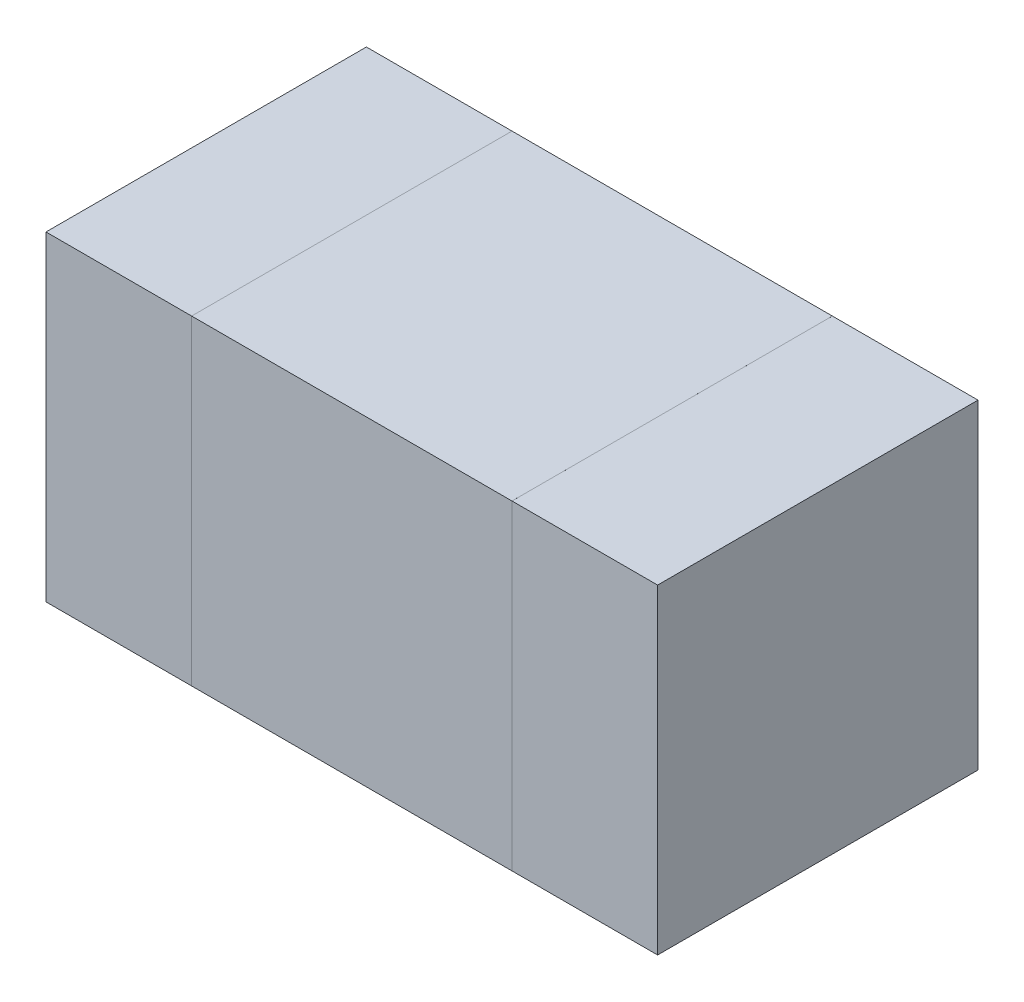
ISO-10303-21;
HEADER;
FILE_DESCRIPTION(('STEP AP214'),'2;1');
FILE_NAME('part.step','',(''),(''),'','','');
FILE_SCHEMA(('AUTOMOTIVE_DESIGN { 1 0 10303 214 1 1 1 1 }'));
ENDSEC;
DATA;
#1=APPLICATION_CONTEXT('core data for automotive mechanical design processes');
#2=APPLICATION_PROTOCOL_DEFINITION('international standard','automotive_design',2000,#1);
#3=PRODUCT_CONTEXT('',#1,'mechanical');
#4=PRODUCT('Part','Part','',(#3));
#5=PRODUCT_RELATED_PRODUCT_CATEGORY('part','',(#4));
#6=PRODUCT_DEFINITION_FORMATION('','',#4);
#7=PRODUCT_DEFINITION_CONTEXT('part definition',#1,'design');
#8=PRODUCT_DEFINITION('design','',#6,#7);
#9=PRODUCT_DEFINITION_SHAPE('','',#8);
#10=(LENGTH_UNIT() NAMED_UNIT(*) SI_UNIT(.MILLI.,.METRE.));
#11=(NAMED_UNIT(*) PLANE_ANGLE_UNIT() SI_UNIT($,.RADIAN.));
#12=(NAMED_UNIT(*) SI_UNIT($,.STERADIAN.) SOLID_ANGLE_UNIT());
#13=UNCERTAINTY_MEASURE_WITH_UNIT(LENGTH_MEASURE(1.E-05),#10,'distance_accuracy_value','');
#14=(GEOMETRIC_REPRESENTATION_CONTEXT(3) GLOBAL_UNCERTAINTY_ASSIGNED_CONTEXT((#13)) GLOBAL_UNIT_ASSIGNED_CONTEXT((#10,
#11,#12)) REPRESENTATION_CONTEXT('',''));
#15=CARTESIAN_POINT('',(0.,0.,0.));
#16=DIRECTION('',(0.,0.,1.));
#17=DIRECTION('',(1.,0.,0.));
#18=AXIS2_PLACEMENT_3D('',#15,#16,#17);
#19=CARTESIAN_POINT('',(1.009987922422,7.410003011953,0.32999934));
#20=DIRECTION('',(0.,0.,-1.));
#21=DIRECTION('',(0.,-1.,0.));
#22=AXIS2_PLACEMENT_3D('',#19,#20,#21);
#23=PLANE('',#22);
#24=DIRECTION('',(1.,0.,0.));
#25=VECTOR('',#24,1.);
#26=CARTESIAN_POINT('',(1.009987922422,7.410003011953,0.32999934));
#27=LINE('',#26,#25);
#28=CARTESIAN_POINT('',(1.009987922422,7.410003011953,0.32999934));
#29=VERTEX_POINT('',#28);
#30=CARTESIAN_POINT('',(1.339989802422,7.410003011953,0.32999934));
#31=VERTEX_POINT('',#30);
#32=EDGE_CURVE('P0_E69',#29,#31,#27,.T.);
#33=ORIENTED_EDGE('',*,*,#32,.T.);
#34=DIRECTION('',(0.,1.,0.));
#35=VECTOR('',#34,1.);
#36=CARTESIAN_POINT('',(1.339989802422,7.410003011953,0.32999934));
#37=LINE('',#36,#35);
#38=CARTESIAN_POINT('',(1.339989802422,7.740002351953,0.32999934));
#39=VERTEX_POINT('',#38);
#40=EDGE_CURVE('P0_E66',#31,#39,#37,.T.);
#41=ORIENTED_EDGE('',*,*,#40,.T.);
#42=DIRECTION('',(-1.,0.,0.));
#43=VECTOR('',#42,1.);
#44=CARTESIAN_POINT('',(1.339989802422,7.740002351953,0.32999934));
#45=LINE('',#44,#43);
#46=CARTESIAN_POINT('',(1.009987922422,7.740002351953,0.32999934));
#47=VERTEX_POINT('',#46);
#48=EDGE_CURVE('P0_E53',#39,#47,#45,.T.);
#49=ORIENTED_EDGE('',*,*,#48,.T.);
#50=DIRECTION('',(0.,-1.,0.));
#51=VECTOR('',#50,1.);
#52=CARTESIAN_POINT('',(1.009987922422,7.740002351953,0.32999934));
#53=LINE('',#52,#51);
#54=EDGE_CURVE('P0_E11',#47,#29,#53,.T.);
#55=ORIENTED_EDGE('',*,*,#54,.T.);
#56=EDGE_LOOP('',(#33,#41,#49,#55));
#57=FACE_BOUND('',#56,.T.);
#58=ADVANCED_FACE('P0_F17',(#57),#23,.F.);
#59=CARTESIAN_POINT('',(1.009987922422,7.410003011953,0.));
#60=DIRECTION('',(0.,0.,-1.));
#61=DIRECTION('',(0.,-1.,0.));
#62=AXIS2_PLACEMENT_3D('',#59,#60,#61);
#63=PLANE('',#62);
#64=DIRECTION('',(0.,-1.,0.));
#65=VECTOR('',#64,1.);
#66=CARTESIAN_POINT('',(1.009987922422,7.740002351953,0.));
#67=LINE('',#66,#65);
#68=CARTESIAN_POINT('',(1.009987922422,7.740002351953,0.));
#69=VERTEX_POINT('',#68);
#70=CARTESIAN_POINT('',(1.009987922422,7.410003011953,0.));
#71=VERTEX_POINT('',#70);
#72=EDGE_CURVE('P0_E26',#69,#71,#67,.T.);
#73=ORIENTED_EDGE('',*,*,#72,.F.);
#74=DIRECTION('',(-1.,0.,0.));
#75=VECTOR('',#74,1.);
#76=CARTESIAN_POINT('',(1.339989802422,7.740002351953,0.));
#77=LINE('',#76,#75);
#78=CARTESIAN_POINT('',(1.339989802422,7.740002351953,0.));
#79=VERTEX_POINT('',#78);
#80=EDGE_CURVE('P0_E74',#79,#69,#77,.T.);
#81=ORIENTED_EDGE('',*,*,#80,.F.);
#82=DIRECTION('',(0.,1.,0.));
#83=VECTOR('',#82,1.);
#84=CARTESIAN_POINT('',(1.339989802422,7.410003011953,0.));
#85=LINE('',#84,#83);
#86=CARTESIAN_POINT('',(1.339989802422,7.410003011953,0.));
#87=VERTEX_POINT('',#86);
#88=EDGE_CURVE('P0_E78',#87,#79,#85,.T.);
#89=ORIENTED_EDGE('',*,*,#88,.F.);
#90=DIRECTION('',(1.,0.,0.));
#91=VECTOR('',#90,1.);
#92=CARTESIAN_POINT('',(1.009987922422,7.410003011953,0.));
#93=LINE('',#92,#91);
#94=EDGE_CURVE('P0_E102',#71,#87,#93,.T.);
#95=ORIENTED_EDGE('',*,*,#94,.F.);
#96=EDGE_LOOP('',(#73,#81,#89,#95));
#97=FACE_BOUND('',#96,.T.);
#98=ADVANCED_FACE('P0_F105',(#97),#63,.T.);
#99=CARTESIAN_POINT('',(1.009987922422,7.740002351953,0.));
#100=DIRECTION('',(1.,0.,0.));
#101=DIRECTION('',(0.,1.,0.));
#102=AXIS2_PLACEMENT_3D('',#99,#100,#101);
#103=PLANE('',#102);
#104=ORIENTED_EDGE('',*,*,#72,.T.);
#105=DIRECTION('',(0.,0.,1.));
#106=VECTOR('',#105,1.);
#107=CARTESIAN_POINT('',(1.009987922422,7.410003011953,0.));
#108=LINE('',#107,#106);
#109=EDGE_CURVE('P0_E83',#71,#29,#108,.T.);
#110=ORIENTED_EDGE('',*,*,#109,.T.);
#111=ORIENTED_EDGE('',*,*,#54,.F.);
#112=DIRECTION('',(0.,0.,1.));
#113=VECTOR('',#112,1.);
#114=CARTESIAN_POINT('',(1.009987922422,7.740002351953,0.));
#115=LINE('',#114,#113);
#116=EDGE_CURVE('P0_E60',#69,#47,#115,.T.);
#117=ORIENTED_EDGE('',*,*,#116,.F.);
#118=EDGE_LOOP('',(#104,#110,#111,#117));
#119=FACE_BOUND('',#118,.T.);
#120=ADVANCED_FACE('P0_F93',(#119),#103,.F.);
#121=CARTESIAN_POINT('',(1.339989802422,7.740002351953,0.));
#122=DIRECTION('',(0.,-1.,0.));
#123=DIRECTION('',(0.,0.,-1.));
#124=AXIS2_PLACEMENT_3D('',#121,#122,#123);
#125=PLANE('',#124);
#126=ORIENTED_EDGE('',*,*,#80,.T.);
#127=ORIENTED_EDGE('',*,*,#116,.T.);
#128=ORIENTED_EDGE('',*,*,#48,.F.);
#129=DIRECTION('',(0.,0.,1.));
#130=VECTOR('',#129,1.);
#131=CARTESIAN_POINT('',(1.339989802422,7.740002351953,0.));
#132=LINE('',#131,#130);
#133=EDGE_CURVE('P0_E58',#79,#39,#132,.T.);
#134=ORIENTED_EDGE('',*,*,#133,.F.);
#135=EDGE_LOOP('',(#126,#127,#128,#134));
#136=FACE_BOUND('',#135,.T.);
#137=ADVANCED_FACE('P0_F56',(#136),#125,.F.);
#138=CARTESIAN_POINT('',(1.339989802422,7.410003011953,0.));
#139=DIRECTION('',(-1.,0.,0.));
#140=DIRECTION('',(0.,0.,1.));
#141=AXIS2_PLACEMENT_3D('',#138,#139,#140);
#142=PLANE('',#141);
#143=ORIENTED_EDGE('',*,*,#88,.T.);
#144=ORIENTED_EDGE('',*,*,#133,.T.);
#145=ORIENTED_EDGE('',*,*,#40,.F.);
#146=DIRECTION('',(0.,0.,1.));
#147=VECTOR('',#146,1.);
#148=CARTESIAN_POINT('',(1.339989802422,7.410003011953,0.));
#149=LINE('',#148,#147);
#150=EDGE_CURVE('P0_E107',#87,#31,#149,.T.);
#151=ORIENTED_EDGE('',*,*,#150,.F.);
#152=EDGE_LOOP('',(#143,#144,#145,#151));
#153=FACE_BOUND('',#152,.T.);
#154=ADVANCED_FACE('P0_F76',(#153),#142,.F.);
#155=CARTESIAN_POINT('',(1.009987922422,7.410003011953,0.));
#156=DIRECTION('',(0.,1.,0.));
#157=DIRECTION('',(1.,0.,0.));
#158=AXIS2_PLACEMENT_3D('',#155,#156,#157);
#159=PLANE('',#158);
#160=ORIENTED_EDGE('',*,*,#94,.T.);
#161=ORIENTED_EDGE('',*,*,#150,.T.);
#162=ORIENTED_EDGE('',*,*,#32,.F.);
#163=ORIENTED_EDGE('',*,*,#109,.F.);
#164=EDGE_LOOP('',(#160,#161,#162,#163));
#165=FACE_BOUND('',#164,.T.);
#166=ADVANCED_FACE('P0_F101',(#165),#159,.F.);
#167=CLOSED_SHELL('',(#58,#98,#120,#137,#154,#166));
#168=MANIFOLD_SOLID_BREP('P0_B1',#167);
#169=CARTESIAN_POINT('',(1.489995475586,7.410000471953,0.32999934));
#170=DIRECTION('',(0.,0.,-1.));
#171=DIRECTION('',(0.,-1.,0.));
#172=AXIS2_PLACEMENT_3D('',#169,#170,#171);
#173=PLANE('',#172);
#174=DIRECTION('',(0.,1.,0.));
#175=VECTOR('',#174,1.);
#176=CARTESIAN_POINT('',(1.489995475586,7.410000471953,0.32999934));
#177=LINE('',#176,#175);
#178=CARTESIAN_POINT('',(1.489995475586,7.410000471953,0.32999934));
#179=VERTEX_POINT('',#178);
#180=CARTESIAN_POINT('',(1.489995475586,7.740002351953,0.32999934));
#181=VERTEX_POINT('',#180);
#182=EDGE_CURVE('P1_E83',#179,#181,#177,.T.);
#183=ORIENTED_EDGE('',*,*,#182,.T.);
#184=DIRECTION('',(-1.,0.,0.));
#185=VECTOR('',#184,1.);
#186=CARTESIAN_POINT('',(1.489995475586,7.740002351953,0.32999934));
#187=LINE('',#186,#185);
#188=CARTESIAN_POINT('',(1.339993235586,7.740002351953,0.32999934));
#189=VERTEX_POINT('',#188);
#190=EDGE_CURVE('P1_E99',#181,#189,#187,.T.);
#191=ORIENTED_EDGE('',*,*,#190,.T.);
#192=DIRECTION('',(0.,-1.,0.));
#193=VECTOR('',#192,1.);
#194=CARTESIAN_POINT('',(1.339993235586,7.740002351953,0.32999934));
#195=LINE('',#194,#193);
#196=CARTESIAN_POINT('',(1.339993235586,7.410000471953,0.32999934));
#197=VERTEX_POINT('',#196);
#198=EDGE_CURVE('P1_E75',#189,#197,#195,.T.);
#199=ORIENTED_EDGE('',*,*,#198,.T.);
#200=DIRECTION('',(1.,0.,0.));
#201=VECTOR('',#200,1.);
#202=CARTESIAN_POINT('',(1.339993235586,7.410000471953,0.32999934));
#203=LINE('',#202,#201);
#204=EDGE_CURVE('P1_E11',#197,#179,#203,.T.);
#205=ORIENTED_EDGE('',*,*,#204,.T.);
#206=EDGE_LOOP('',(#183,#191,#199,#205));
#207=FACE_BOUND('',#206,.T.);
#208=ADVANCED_FACE('P1_F17',(#207),#173,.F.);
#209=CARTESIAN_POINT('',(1.489995475586,7.410000471953,0.));
#210=DIRECTION('',(0.,0.,-1.));
#211=DIRECTION('',(0.,-1.,0.));
#212=AXIS2_PLACEMENT_3D('',#209,#210,#211);
#213=PLANE('',#212);
#214=DIRECTION('',(1.,0.,0.));
#215=VECTOR('',#214,1.);
#216=CARTESIAN_POINT('',(1.339993235586,7.410000471953,0.));
#217=LINE('',#216,#215);
#218=CARTESIAN_POINT('',(1.339993235586,7.410000471953,0.));
#219=VERTEX_POINT('',#218);
#220=CARTESIAN_POINT('',(1.489995475586,7.410000471953,0.));
#221=VERTEX_POINT('',#220);
#222=EDGE_CURVE('P1_E26',#219,#221,#217,.T.);
#223=ORIENTED_EDGE('',*,*,#222,.F.);
#224=DIRECTION('',(0.,-1.,0.));
#225=VECTOR('',#224,1.);
#226=CARTESIAN_POINT('',(1.339993235586,7.740002351953,0.));
#227=LINE('',#226,#225);
#228=CARTESIAN_POINT('',(1.339993235586,7.740002351953,0.));
#229=VERTEX_POINT('',#228);
#230=EDGE_CURVE('P1_E97',#229,#219,#227,.T.);
#231=ORIENTED_EDGE('',*,*,#230,.F.);
#232=DIRECTION('',(-1.,0.,0.));
#233=VECTOR('',#232,1.);
#234=CARTESIAN_POINT('',(1.489995475586,7.740002351953,0.));
#235=LINE('',#234,#233);
#236=CARTESIAN_POINT('',(1.489995475586,7.740002351953,0.));
#237=VERTEX_POINT('',#236);
#238=EDGE_CURVE('P1_E85',#237,#229,#235,.T.);
#239=ORIENTED_EDGE('',*,*,#238,.F.);
#240=DIRECTION('',(0.,1.,0.));
#241=VECTOR('',#240,1.);
#242=CARTESIAN_POINT('',(1.489995475586,7.410000471953,0.));
#243=LINE('',#242,#241);
#244=EDGE_CURVE('P1_E81',#221,#237,#243,.T.);
#245=ORIENTED_EDGE('',*,*,#244,.F.);
#246=EDGE_LOOP('',(#223,#231,#239,#245));
#247=FACE_BOUND('',#246,.T.);
#248=ADVANCED_FACE('P1_F19',(#247),#213,.T.);
#249=CARTESIAN_POINT('',(1.339993235586,7.410000471953,0.));
#250=DIRECTION('',(0.,1.,0.));
#251=DIRECTION('',(1.,0.,0.));
#252=AXIS2_PLACEMENT_3D('',#249,#250,#251);
#253=PLANE('',#252);
#254=ORIENTED_EDGE('',*,*,#222,.T.);
#255=DIRECTION('',(0.,0.,1.));
#256=VECTOR('',#255,1.);
#257=CARTESIAN_POINT('',(1.489995475586,7.410000471953,0.));
#258=LINE('',#257,#256);
#259=EDGE_CURVE('P1_E69',#221,#179,#258,.T.);
#260=ORIENTED_EDGE('',*,*,#259,.T.);
#261=ORIENTED_EDGE('',*,*,#204,.F.);
#262=DIRECTION('',(0.,0.,1.));
#263=VECTOR('',#262,1.);
#264=CARTESIAN_POINT('',(1.339993235586,7.410000471953,0.));
#265=LINE('',#264,#263);
#266=EDGE_CURVE('P1_E72',#219,#197,#265,.T.);
#267=ORIENTED_EDGE('',*,*,#266,.F.);
#268=EDGE_LOOP('',(#254,#260,#261,#267));
#269=FACE_BOUND('',#268,.T.);
#270=ADVANCED_FACE('P1_F68',(#269),#253,.F.);
#271=CARTESIAN_POINT('',(1.339993235586,7.740002351953,0.));
#272=DIRECTION('',(1.,0.,0.));
#273=DIRECTION('',(0.,1.,0.));
#274=AXIS2_PLACEMENT_3D('',#271,#272,#273);
#275=PLANE('',#274);
#276=ORIENTED_EDGE('',*,*,#230,.T.);
#277=ORIENTED_EDGE('',*,*,#266,.T.);
#278=ORIENTED_EDGE('',*,*,#198,.F.);
#279=DIRECTION('',(0.,0.,1.));
#280=VECTOR('',#279,1.);
#281=CARTESIAN_POINT('',(1.339993235586,7.740002351953,0.));
#282=LINE('',#281,#280);
#283=EDGE_CURVE('P1_E104',#229,#189,#282,.T.);
#284=ORIENTED_EDGE('',*,*,#283,.F.);
#285=EDGE_LOOP('',(#276,#277,#278,#284));
#286=FACE_BOUND('',#285,.T.);
#287=ADVANCED_FACE('P1_F117',(#286),#275,.F.);
#288=CARTESIAN_POINT('',(1.489995475586,7.740002351953,0.));
#289=DIRECTION('',(0.,-1.,0.));
#290=DIRECTION('',(0.,0.,-1.));
#291=AXIS2_PLACEMENT_3D('',#288,#289,#290);
#292=PLANE('',#291);
#293=ORIENTED_EDGE('',*,*,#238,.T.);
#294=ORIENTED_EDGE('',*,*,#283,.T.);
#295=ORIENTED_EDGE('',*,*,#190,.F.);
#296=DIRECTION('',(0.,0.,1.));
#297=VECTOR('',#296,1.);
#298=CARTESIAN_POINT('',(1.489995475586,7.740002351953,0.));
#299=LINE('',#298,#297);
#300=EDGE_CURVE('P1_E90',#237,#181,#299,.T.);
#301=ORIENTED_EDGE('',*,*,#300,.F.);
#302=EDGE_LOOP('',(#293,#294,#295,#301));
#303=FACE_BOUND('',#302,.T.);
#304=ADVANCED_FACE('P1_F119',(#303),#292,.F.);
#305=CARTESIAN_POINT('',(1.489995475586,7.410000471953,0.));
#306=DIRECTION('',(-1.,0.,0.));
#307=DIRECTION('',(0.,0.,1.));
#308=AXIS2_PLACEMENT_3D('',#305,#306,#307);
#309=PLANE('',#308);
#310=ORIENTED_EDGE('',*,*,#244,.T.);
#311=ORIENTED_EDGE('',*,*,#300,.T.);
#312=ORIENTED_EDGE('',*,*,#182,.F.);
#313=ORIENTED_EDGE('',*,*,#259,.F.);
#314=EDGE_LOOP('',(#310,#311,#312,#313));
#315=FACE_BOUND('',#314,.T.);
#316=ADVANCED_FACE('P1_F79',(#315),#309,.F.);
#317=CLOSED_SHELL('',(#208,#248,#270,#287,#304,#316));
#318=MANIFOLD_SOLID_BREP('P1_B1',#317);
#319=CARTESIAN_POINT('',(1.009999748047,7.410000471953,0.32999934));
#320=DIRECTION('',(0.,0.,-1.));
#321=DIRECTION('',(0.,-1.,0.));
#322=AXIS2_PLACEMENT_3D('',#319,#320,#321);
#323=PLANE('',#322);
#324=DIRECTION('',(0.,1.,0.));
#325=VECTOR('',#324,1.);
#326=CARTESIAN_POINT('',(1.009999748047,7.410000471953,0.32999934));
#327=LINE('',#326,#325);
#328=CARTESIAN_POINT('',(1.009999748047,7.410000471953,0.32999934));
#329=VERTEX_POINT('',#328);
#330=CARTESIAN_POINT('',(1.009999748047,7.740002351953,0.32999934));
#331=VERTEX_POINT('',#330);
#332=EDGE_CURVE('P2_E79',#329,#331,#327,.T.);
#333=ORIENTED_EDGE('',*,*,#332,.T.);
#334=DIRECTION('',(-1.,0.,0.));
#335=VECTOR('',#334,1.);
#336=CARTESIAN_POINT('',(1.009999748047,7.740002351953,0.32999934));
#337=LINE('',#336,#335);
#338=CARTESIAN_POINT('',(0.859997508047,7.740002351953,0.32999934));
#339=VERTEX_POINT('',#338);
#340=EDGE_CURVE('P2_E77',#331,#339,#337,.T.);
#341=ORIENTED_EDGE('',*,*,#340,.T.);
#342=DIRECTION('',(0.,-1.,0.));
#343=VECTOR('',#342,1.);
#344=CARTESIAN_POINT('',(0.859997508047,7.740002351953,0.32999934));
#345=LINE('',#344,#343);
#346=CARTESIAN_POINT('',(0.859997508047,7.410000471953,0.32999934));
#347=VERTEX_POINT('',#346);
#348=EDGE_CURVE('P2_E66',#339,#347,#345,.T.);
#349=ORIENTED_EDGE('',*,*,#348,.T.);
#350=DIRECTION('',(1.,0.,0.));
#351=VECTOR('',#350,1.);
#352=CARTESIAN_POINT('',(0.859997508047,7.410000471953,0.32999934));
#353=LINE('',#352,#351);
#354=EDGE_CURVE('P2_E11',#347,#329,#353,.T.);
#355=ORIENTED_EDGE('',*,*,#354,.T.);
#356=EDGE_LOOP('',(#333,#341,#349,#355));
#357=FACE_BOUND('',#356,.T.);
#358=ADVANCED_FACE('P2_F17',(#357),#323,.F.);
#359=CARTESIAN_POINT('',(1.009999748047,7.410000471953,0.));
#360=DIRECTION('',(0.,0.,-1.));
#361=DIRECTION('',(0.,-1.,0.));
#362=AXIS2_PLACEMENT_3D('',#359,#360,#361);
#363=PLANE('',#362);
#364=DIRECTION('',(1.,0.,0.));
#365=VECTOR('',#364,1.);
#366=CARTESIAN_POINT('',(0.859997508047,7.410000471953,0.));
#367=LINE('',#366,#365);
#368=CARTESIAN_POINT('',(0.859997508047,7.410000471953,0.));
#369=VERTEX_POINT('',#368);
#370=CARTESIAN_POINT('',(1.009999748047,7.410000471953,0.));
#371=VERTEX_POINT('',#370);
#372=EDGE_CURVE('P2_E20',#369,#371,#367,.T.);
#373=ORIENTED_EDGE('',*,*,#372,.F.);
#374=DIRECTION('',(0.,-1.,0.));
#375=VECTOR('',#374,1.);
#376=CARTESIAN_POINT('',(0.859997508047,7.740002351953,0.));
#377=LINE('',#376,#375);
#378=CARTESIAN_POINT('',(0.859997508047,7.740002351953,0.));
#379=VERTEX_POINT('',#378);
#380=EDGE_CURVE('P2_E84',#379,#369,#377,.T.);
#381=ORIENTED_EDGE('',*,*,#380,.F.);
#382=DIRECTION('',(-1.,0.,0.));
#383=VECTOR('',#382,1.);
#384=CARTESIAN_POINT('',(1.009999748047,7.740002351953,0.));
#385=LINE('',#384,#383);
#386=CARTESIAN_POINT('',(1.009999748047,7.740002351953,0.));
#387=VERTEX_POINT('',#386);
#388=EDGE_CURVE('P2_E87',#387,#379,#385,.T.);
#389=ORIENTED_EDGE('',*,*,#388,.F.);
#390=DIRECTION('',(0.,1.,0.));
#391=VECTOR('',#390,1.);
#392=CARTESIAN_POINT('',(1.009999748047,7.410000471953,0.));
#393=LINE('',#392,#391);
#394=EDGE_CURVE('P2_E98',#371,#387,#393,.T.);
#395=ORIENTED_EDGE('',*,*,#394,.F.);
#396=EDGE_LOOP('',(#373,#381,#389,#395));
#397=FACE_BOUND('',#396,.T.);
#398=ADVANCED_FACE('P2_F141',(#397),#363,.T.);
#399=CARTESIAN_POINT('',(0.859997508047,7.410000471953,0.));
#400=DIRECTION('',(0.,1.,0.));
#401=DIRECTION('',(1.,0.,0.));
#402=AXIS2_PLACEMENT_3D('',#399,#400,#401);
#403=PLANE('',#402);
#404=ORIENTED_EDGE('',*,*,#372,.T.);
#405=DIRECTION('',(0.,0.,1.));
#406=VECTOR('',#405,1.);
#407=CARTESIAN_POINT('',(1.009999748047,7.410000471953,0.));
#408=LINE('',#407,#406);
#409=EDGE_CURVE('P2_E94',#371,#329,#408,.T.);
#410=ORIENTED_EDGE('',*,*,#409,.T.);
#411=ORIENTED_EDGE('',*,*,#354,.F.);
#412=DIRECTION('',(0.,0.,1.));
#413=VECTOR('',#412,1.);
#414=CARTESIAN_POINT('',(0.859997508047,7.410000471953,0.));
#415=LINE('',#414,#413);
#416=EDGE_CURVE('P2_E73',#369,#347,#415,.T.);
#417=ORIENTED_EDGE('',*,*,#416,.F.);
#418=EDGE_LOOP('',(#404,#410,#411,#417));
#419=FACE_BOUND('',#418,.T.);
#420=ADVANCED_FACE('P2_F134',(#419),#403,.F.);
#421=CARTESIAN_POINT('',(0.859997508047,7.740002351953,0.));
#422=DIRECTION('',(1.,0.,0.));
#423=DIRECTION('',(0.,1.,0.));
#424=AXIS2_PLACEMENT_3D('',#421,#422,#423);
#425=PLANE('',#424);
#426=ORIENTED_EDGE('',*,*,#380,.T.);
#427=ORIENTED_EDGE('',*,*,#416,.T.);
#428=ORIENTED_EDGE('',*,*,#348,.F.);
#429=DIRECTION('',(0.,0.,1.));
#430=VECTOR('',#429,1.);
#431=CARTESIAN_POINT('',(0.859997508047,7.740002351953,0.));
#432=LINE('',#431,#430);
#433=EDGE_CURVE('P2_E71',#379,#339,#432,.T.);
#434=ORIENTED_EDGE('',*,*,#433,.F.);
#435=EDGE_LOOP('',(#426,#427,#428,#434));
#436=FACE_BOUND('',#435,.T.);
#437=ADVANCED_FACE('P2_F69',(#436),#425,.F.);
#438=CARTESIAN_POINT('',(1.009999748047,7.740002351953,0.));
#439=DIRECTION('',(0.,-1.,0.));
#440=DIRECTION('',(0.,0.,-1.));
#441=AXIS2_PLACEMENT_3D('',#438,#439,#440);
#442=PLANE('',#441);
#443=ORIENTED_EDGE('',*,*,#388,.T.);
#444=ORIENTED_EDGE('',*,*,#433,.T.);
#445=ORIENTED_EDGE('',*,*,#340,.F.);
#446=DIRECTION('',(0.,0.,1.));
#447=VECTOR('',#446,1.);
#448=CARTESIAN_POINT('',(1.009999748047,7.740002351953,0.));
#449=LINE('',#448,#447);
#450=EDGE_CURVE('P2_E100',#387,#331,#449,.T.);
#451=ORIENTED_EDGE('',*,*,#450,.F.);
#452=EDGE_LOOP('',(#443,#444,#445,#451));
#453=FACE_BOUND('',#452,.T.);
#454=ADVANCED_FACE('P2_F86',(#453),#442,.F.);
#455=CARTESIAN_POINT('',(1.009999748047,7.410000471953,0.));
#456=DIRECTION('',(-1.,0.,0.));
#457=DIRECTION('',(0.,0.,1.));
#458=AXIS2_PLACEMENT_3D('',#455,#456,#457);
#459=PLANE('',#458);
#460=ORIENTED_EDGE('',*,*,#394,.T.);
#461=ORIENTED_EDGE('',*,*,#450,.T.);
#462=ORIENTED_EDGE('',*,*,#332,.F.);
#463=ORIENTED_EDGE('',*,*,#409,.F.);
#464=EDGE_LOOP('',(#460,#461,#462,#463));
#465=FACE_BOUND('',#464,.T.);
#466=ADVANCED_FACE('P2_F115',(#465),#459,.F.);
#467=CLOSED_SHELL('',(#358,#398,#420,#437,#454,#466));
#468=MANIFOLD_SOLID_BREP('P2_B1',#467);
#469=ADVANCED_BREP_SHAPE_REPRESENTATION('',(#18,#168,#318,#468),#14);
#470=SHAPE_DEFINITION_REPRESENTATION(#9,#469);
ENDSEC;
END-ISO-10303-21;
